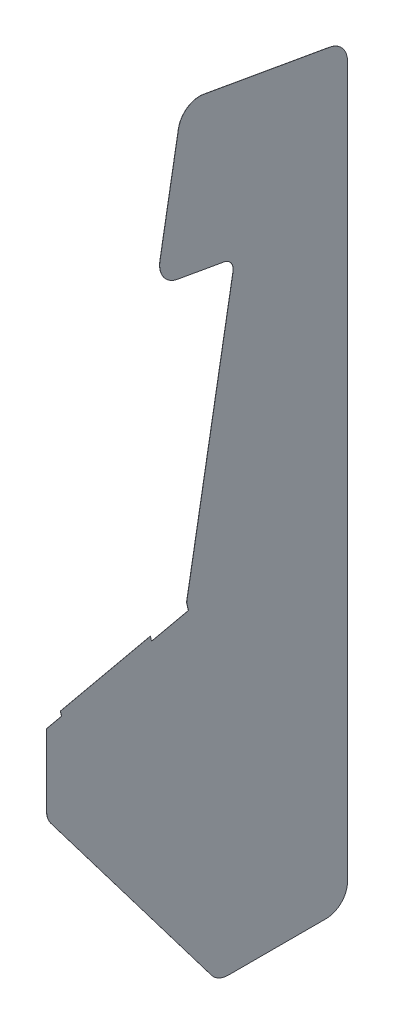
ISO-10303-21;
HEADER;
FILE_DESCRIPTION(('STEP AP214'),'2;1');
FILE_NAME('part.step','',(''),(''),'','','');
FILE_SCHEMA(('AUTOMOTIVE_DESIGN { 1 0 10303 214 1 1 1 1 }'));
ENDSEC;
DATA;
#1=APPLICATION_CONTEXT('core data for automotive mechanical design processes');
#2=APPLICATION_PROTOCOL_DEFINITION('international standard','automotive_design',2000,#1);
#3=PRODUCT_CONTEXT('',#1,'mechanical');
#4=PRODUCT('Part','Part','',(#3));
#5=PRODUCT_RELATED_PRODUCT_CATEGORY('part','',(#4));
#6=PRODUCT_DEFINITION_FORMATION('','',#4);
#7=PRODUCT_DEFINITION_CONTEXT('part definition',#1,'design');
#8=PRODUCT_DEFINITION('design','',#6,#7);
#9=PRODUCT_DEFINITION_SHAPE('','',#8);
#10=(LENGTH_UNIT() NAMED_UNIT(*) SI_UNIT(.MILLI.,.METRE.));
#11=(NAMED_UNIT(*) PLANE_ANGLE_UNIT() SI_UNIT($,.RADIAN.));
#12=(NAMED_UNIT(*) SI_UNIT($,.STERADIAN.) SOLID_ANGLE_UNIT());
#13=UNCERTAINTY_MEASURE_WITH_UNIT(LENGTH_MEASURE(1.E-05),#10,'distance_accuracy_value','');
#14=(GEOMETRIC_REPRESENTATION_CONTEXT(3) GLOBAL_UNCERTAINTY_ASSIGNED_CONTEXT((#13)) GLOBAL_UNIT_ASSIGNED_CONTEXT((#10,
#11,#12)) REPRESENTATION_CONTEXT('',''));
#15=CARTESIAN_POINT('',(0.,0.,0.));
#16=DIRECTION('',(0.,0.,1.));
#17=DIRECTION('',(1.,0.,0.));
#18=AXIS2_PLACEMENT_3D('',#15,#16,#17);
#19=CARTESIAN_POINT('',(-0.1016,-432.193888214697,-274.200562117222));
#20=DIRECTION('',(1.,0.,0.));
#21=DIRECTION('',(0.,0.,-1.));
#22=AXIS2_PLACEMENT_3D('',#19,#20,#21);
#23=CYLINDRICAL_SURFACE('',#22,33.3375);
#24=CARTESIAN_POINT('',(0.1016,-432.193888214697,-274.200562117222));
#25=DIRECTION('',(1.,0.,0.));
#26=DIRECTION('',(0.,0.,-1.));
#27=AXIS2_PLACEMENT_3D('',#24,#25,#26);
#28=CIRCLE('',#27,33.3375);
#29=CARTESIAN_POINT('',(0.1016,-452.33460121024,-247.634783636606));
#30=VERTEX_POINT('',#29);
#31=CARTESIAN_POINT('',(0.1016,-465.531388214697,-274.200562117222));
#32=VERTEX_POINT('',#31);
#33=EDGE_CURVE('E209',#30,#32,#28,.T.);
#34=ORIENTED_EDGE('',*,*,#33,.F.);
#35=DIRECTION('',(1.,0.,0.));
#36=VECTOR('',#35,1.);
#37=CARTESIAN_POINT('',(-0.1016,-452.33460121024,-247.634783636606));
#38=LINE('',#37,#36);
#39=CARTESIAN_POINT('',(-0.1016,-452.33460121024,-247.634783636606));
#40=VERTEX_POINT('',#39);
#41=EDGE_CURVE('E11',#40,#30,#38,.T.);
#42=ORIENTED_EDGE('',*,*,#41,.F.);
#43=CARTESIAN_POINT('',(-0.1016,-432.193888214697,-274.200562117222));
#44=DIRECTION('',(1.,0.,0.));
#45=DIRECTION('',(0.,0.,-1.));
#46=AXIS2_PLACEMENT_3D('',#43,#44,#45);
#47=CIRCLE('',#46,33.3375);
#48=CARTESIAN_POINT('',(-0.1016,-465.531388214697,-274.200562117222));
#49=VERTEX_POINT('',#48);
#50=EDGE_CURVE('E268',#40,#49,#47,.T.);
#51=ORIENTED_EDGE('',*,*,#50,.T.);
#52=DIRECTION('',(1.,0.,0.));
#53=VECTOR('',#52,1.);
#54=CARTESIAN_POINT('',(-0.1016,-465.531388214697,-274.200562117222));
#55=LINE('',#54,#53);
#56=EDGE_CURVE('E38',#49,#32,#55,.T.);
#57=ORIENTED_EDGE('',*,*,#56,.T.);
#58=EDGE_LOOP('',(#34,#42,#51,#57));
#59=FACE_BOUND('',#58,.T.);
#60=ADVANCED_FACE('F34',(#59),#23,.T.);
#61=CARTESIAN_POINT('',(-0.1016,-124.164460435114,1.16577848061592));
#62=DIRECTION('',(0.,-0.604145871632343,0.796873745200327));
#63=DIRECTION('',(0.,-0.796873745200327,-0.604145871632343));
#64=AXIS2_PLACEMENT_3D('',#61,#62,#63);
#65=PLANE('',#64);
#66=DIRECTION('',(0.,-0.796873745200327,-0.604145871632344));
#67=VECTOR('',#66,1.);
#68=CARTESIAN_POINT('',(0.1016,-124.164460435114,1.16577848061592));
#69=LINE('',#68,#67);
#70=CARTESIAN_POINT('',(0.1016,-124.164460435114,1.16577848061593));
#71=VERTEX_POINT('',#70);
#72=EDGE_CURVE('E266',#71,#30,#69,.T.);
#73=ORIENTED_EDGE('',*,*,#72,.F.);
#74=DIRECTION('',(1.,0.,0.));
#75=VECTOR('',#74,1.);
#76=CARTESIAN_POINT('',(-0.1016,-124.164460435114,1.16577848061593));
#77=LINE('',#76,#75);
#78=CARTESIAN_POINT('',(-0.1016,-124.164460435114,1.16577848061593));
#79=VERTEX_POINT('',#78);
#80=EDGE_CURVE('E44',#79,#71,#77,.T.);
#81=ORIENTED_EDGE('',*,*,#80,.F.);
#82=DIRECTION('',(0.,-0.796873745200327,-0.604145871632344));
#83=VECTOR('',#82,1.);
#84=CARTESIAN_POINT('',(-0.1016,-124.164460435114,1.16577848061592));
#85=LINE('',#84,#83);
#86=EDGE_CURVE('E199',#79,#40,#85,.T.);
#87=ORIENTED_EDGE('',*,*,#86,.T.);
#88=ORIENTED_EDGE('',*,*,#41,.T.);
#89=EDGE_LOOP('',(#73,#81,#87,#88));
#90=FACE_BOUND('',#89,.T.);
#91=ADVANCED_FACE('F306',(#90),#65,.T.);
#92=CARTESIAN_POINT('',(-0.1016,-104.023747439571,-25.4));
#93=DIRECTION('',(1.,0.,0.));
#94=DIRECTION('',(0.,0.,-1.));
#95=AXIS2_PLACEMENT_3D('',#92,#93,#94);
#96=CYLINDRICAL_SURFACE('',#95,33.3375);
#97=CARTESIAN_POINT('',(0.1016,-104.023747439571,-25.4));
#98=DIRECTION('',(1.,0.,0.));
#99=DIRECTION('',(0.,0.,-1.));
#100=AXIS2_PLACEMENT_3D('',#97,#98,#99);
#101=CIRCLE('',#100,33.3375);
#102=CARTESIAN_POINT('',(0.1016,-104.023747439571,7.93750000000001));
#103=VERTEX_POINT('',#102);
#104=EDGE_CURVE('E187',#103,#71,#101,.T.);
#105=ORIENTED_EDGE('',*,*,#104,.F.);
#106=DIRECTION('',(1.,0.,0.));
#107=VECTOR('',#106,1.);
#108=CARTESIAN_POINT('',(-0.1016,-104.023747439571,7.93750000000001));
#109=LINE('',#108,#107);
#110=CARTESIAN_POINT('',(-0.1016,-104.023747439571,7.93750000000001));
#111=VERTEX_POINT('',#110);
#112=EDGE_CURVE('E182',#111,#103,#109,.T.);
#113=ORIENTED_EDGE('',*,*,#112,.F.);
#114=CARTESIAN_POINT('',(-0.1016,-104.023747439571,-25.4));
#115=DIRECTION('',(1.,0.,0.));
#116=DIRECTION('',(0.,0.,-1.));
#117=AXIS2_PLACEMENT_3D('',#114,#115,#116);
#118=CIRCLE('',#117,33.3375);
#119=EDGE_CURVE('E185',#111,#79,#118,.T.);
#120=ORIENTED_EDGE('',*,*,#119,.T.);
#121=ORIENTED_EDGE('',*,*,#80,.T.);
#122=EDGE_LOOP('',(#105,#113,#120,#121));
#123=FACE_BOUND('',#122,.T.);
#124=ADVANCED_FACE('F184',(#123),#96,.T.);
#125=CARTESIAN_POINT('',(-0.1016,6.37051726014308,7.93750000000003));
#126=DIRECTION('',(0.,0.,1.));
#127=DIRECTION('',(0.,-1.,0.));
#128=AXIS2_PLACEMENT_3D('',#125,#126,#127);
#129=PLANE('',#128);
#130=DIRECTION('',(0.,-1.,0.));
#131=VECTOR('',#130,1.);
#132=CARTESIAN_POINT('',(0.1016,6.37051726014308,7.93750000000003));
#133=LINE('',#132,#131);
#134=CARTESIAN_POINT('',(0.1016,6.37051726014308,7.93750000000003));
#135=VERTEX_POINT('',#134);
#136=EDGE_CURVE('E263',#135,#103,#133,.T.);
#137=ORIENTED_EDGE('',*,*,#136,.F.);
#138=DIRECTION('',(1.,0.,0.));
#139=VECTOR('',#138,1.);
#140=CARTESIAN_POINT('',(-0.1016,6.37051726014308,7.93750000000003));
#141=LINE('',#140,#139);
#142=CARTESIAN_POINT('',(-0.1016,6.37051726014308,7.93750000000003));
#143=VERTEX_POINT('',#142);
#144=EDGE_CURVE('E192',#143,#135,#141,.T.);
#145=ORIENTED_EDGE('',*,*,#144,.F.);
#146=DIRECTION('',(0.,-1.,0.));
#147=VECTOR('',#146,1.);
#148=CARTESIAN_POINT('',(-0.1016,6.37051726014308,7.93750000000003));
#149=LINE('',#148,#147);
#150=EDGE_CURVE('E197',#143,#111,#149,.T.);
#151=ORIENTED_EDGE('',*,*,#150,.T.);
#152=ORIENTED_EDGE('',*,*,#112,.T.);
#153=EDGE_LOOP('',(#137,#145,#151,#152));
#154=FACE_BOUND('',#153,.T.);
#155=ADVANCED_FACE('F201',(#154),#129,.T.);
#156=CARTESIAN_POINT('',(-0.1016,11.5289263149086,-15.3305795886981));
#157=DIRECTION('',(0.,0.976296007119933,0.216439613938103));
#158=DIRECTION('',(0.,-0.216439613938103,0.976296007119933));
#159=AXIS2_PLACEMENT_3D('',#156,#157,#158);
#160=PLANE('',#159);
#161=DIRECTION('',(0.,-0.216439613938103,0.976296007119933));
#162=VECTOR('',#161,1.);
#163=CARTESIAN_POINT('',(0.1016,11.5289263149086,-15.3305795886981));
#164=LINE('',#163,#162);
#165=CARTESIAN_POINT('',(0.1016,11.5289263149086,-15.3305795886981));
#166=VERTEX_POINT('',#165);
#167=EDGE_CURVE('E260',#166,#135,#164,.T.);
#168=ORIENTED_EDGE('',*,*,#167,.F.);
#169=DIRECTION('',(1.,0.,0.));
#170=VECTOR('',#169,1.);
#171=CARTESIAN_POINT('',(-0.1016,11.5289263149086,-15.3305795886981));
#172=LINE('',#171,#170);
#173=CARTESIAN_POINT('',(-0.1016,11.5289263149086,-15.3305795886981));
#174=VERTEX_POINT('',#173);
#175=EDGE_CURVE('E272',#174,#166,#172,.T.);
#176=ORIENTED_EDGE('',*,*,#175,.F.);
#177=DIRECTION('',(0.,-0.216439613938103,0.976296007119933));
#178=VECTOR('',#177,1.);
#179=CARTESIAN_POINT('',(-0.1016,11.5289263149086,-15.3305795886981));
#180=LINE('',#179,#178);
#181=EDGE_CURVE('E202',#174,#143,#180,.T.);
#182=ORIENTED_EDGE('',*,*,#181,.T.);
#183=ORIENTED_EDGE('',*,*,#144,.T.);
#184=EDGE_LOOP('',(#168,#176,#182,#183));
#185=FACE_BOUND('',#184,.T.);
#186=ADVANCED_FACE('F318',(#185),#160,.T.);
#187=CARTESIAN_POINT('',(-0.1016,19.2782758714231,-13.6125901530644));
#188=DIRECTION('',(0.,-0.216439613938102,0.976296007119934));
#189=DIRECTION('',(0.,-0.976296007119934,-0.216439613938102));
#190=AXIS2_PLACEMENT_3D('',#187,#188,#189);
#191=PLANE('',#190);
#192=DIRECTION('',(0.,-0.976296007119934,-0.216439613938102));
#193=VECTOR('',#192,1.);
#194=CARTESIAN_POINT('',(0.1016,19.2782758714231,-13.6125901530644));
#195=LINE('',#194,#193);
#196=CARTESIAN_POINT('',(0.1016,19.2782758714231,-13.6125901530644));
#197=VERTEX_POINT('',#196);
#198=EDGE_CURVE('E257',#197,#166,#195,.T.);
#199=ORIENTED_EDGE('',*,*,#198,.F.);
#200=DIRECTION('',(1.,0.,0.));
#201=VECTOR('',#200,1.);
#202=CARTESIAN_POINT('',(-0.1016,19.2782758714231,-13.6125901530644));
#203=LINE('',#202,#201);
#204=CARTESIAN_POINT('',(-0.1016,19.2782758714231,-13.6125901530644));
#205=VERTEX_POINT('',#204);
#206=EDGE_CURVE('E274',#205,#197,#203,.T.);
#207=ORIENTED_EDGE('',*,*,#206,.F.);
#208=DIRECTION('',(0.,-0.976296007119934,-0.216439613938102));
#209=VECTOR('',#208,1.);
#210=CARTESIAN_POINT('',(-0.1016,19.2782758714231,-13.6125901530644));
#211=LINE('',#210,#209);
#212=EDGE_CURVE('E204',#205,#174,#211,.T.);
#213=ORIENTED_EDGE('',*,*,#212,.T.);
#214=ORIENTED_EDGE('',*,*,#175,.T.);
#215=EDGE_LOOP('',(#199,#207,#213,#214));
#216=FACE_BOUND('',#215,.T.);
#217=ADVANCED_FACE('F321',(#216),#191,.T.);
#218=CARTESIAN_POINT('',(-0.1016,50.2020857128297,-153.100882170325));
#219=DIRECTION('',(0.,0.976296007119933,0.216439613938104));
#220=DIRECTION('',(0.,-0.216439613938104,0.976296007119933));
#221=AXIS2_PLACEMENT_3D('',#218,#219,#220);
#222=PLANE('',#221);
#223=DIRECTION('',(0.,-0.216439613938104,0.976296007119933));
#224=VECTOR('',#223,1.);
#225=CARTESIAN_POINT('',(0.1016,50.2020857128297,-153.100882170325));
#226=LINE('',#225,#224);
#227=CARTESIAN_POINT('',(0.1016,50.2020857128297,-153.100882170325));
#228=VERTEX_POINT('',#227);
#229=EDGE_CURVE('E254',#228,#197,#226,.T.);
#230=ORIENTED_EDGE('',*,*,#229,.F.);
#231=DIRECTION('',(1.,0.,0.));
#232=VECTOR('',#231,1.);
#233=CARTESIAN_POINT('',(-0.1016,50.2020857128297,-153.100882170325));
#234=LINE('',#233,#232);
#235=CARTESIAN_POINT('',(-0.1016,50.2020857128297,-153.100882170325));
#236=VERTEX_POINT('',#235);
#237=EDGE_CURVE('E276',#236,#228,#234,.T.);
#238=ORIENTED_EDGE('',*,*,#237,.F.);
#239=DIRECTION('',(0.,-0.216439613938104,0.976296007119933));
#240=VECTOR('',#239,1.);
#241=CARTESIAN_POINT('',(-0.1016,50.2020857128297,-153.100882170325));
#242=LINE('',#241,#240);
#243=EDGE_CURVE('E585',#236,#205,#242,.T.);
#244=ORIENTED_EDGE('',*,*,#243,.T.);
#245=ORIENTED_EDGE('',*,*,#206,.T.);
#246=EDGE_LOOP('',(#230,#238,#244,#245));
#247=FACE_BOUND('',#246,.T.);
#248=ADVANCED_FACE('F325',(#247),#222,.T.);
#249=CARTESIAN_POINT('',(-0.1016,42.4527361563152,-154.818871605959));
#250=DIRECTION('',(0.,0.216439613938109,-0.976296007119932));
#251=DIRECTION('',(0.,0.976296007119932,0.216439613938109));
#252=AXIS2_PLACEMENT_3D('',#249,#250,#251);
#253=PLANE('',#252);
#254=DIRECTION('',(0.,0.976296007119932,0.216439613938109));
#255=VECTOR('',#254,1.);
#256=CARTESIAN_POINT('',(0.1016,42.4527361563152,-154.818871605959));
#257=LINE('',#256,#255);
#258=CARTESIAN_POINT('',(0.1016,42.4527361563152,-154.818871605959));
#259=VERTEX_POINT('',#258);
#260=EDGE_CURVE('E251',#259,#228,#257,.T.);
#261=ORIENTED_EDGE('',*,*,#260,.F.);
#262=DIRECTION('',(1.,0.,0.));
#263=VECTOR('',#262,1.);
#264=CARTESIAN_POINT('',(-0.1016,42.4527361563152,-154.818871605959));
#265=LINE('',#264,#263);
#266=CARTESIAN_POINT('',(-0.1016,42.4527361563152,-154.818871605959));
#267=VERTEX_POINT('',#266);
#268=EDGE_CURVE('E278',#267,#259,#265,.T.);
#269=ORIENTED_EDGE('',*,*,#268,.F.);
#270=DIRECTION('',(0.,0.976296007119932,0.216439613938109));
#271=VECTOR('',#270,1.);
#272=CARTESIAN_POINT('',(-0.1016,42.4527361563152,-154.818871605959));
#273=LINE('',#272,#271);
#274=EDGE_CURVE('E589',#267,#236,#273,.T.);
#275=ORIENTED_EDGE('',*,*,#274,.T.);
#276=ORIENTED_EDGE('',*,*,#237,.T.);
#277=EDGE_LOOP('',(#261,#269,#275,#276));
#278=FACE_BOUND('',#277,.T.);
#279=ADVANCED_FACE('F329',(#278),#253,.T.);
#280=CARTESIAN_POINT('',(-0.1016,55.1397816501158,-212.046435601192));
#281=DIRECTION('',(0.,0.976296007119933,0.216439613938103));
#282=DIRECTION('',(0.,-0.216439613938104,0.976296007119933));
#283=AXIS2_PLACEMENT_3D('',#280,#281,#282);
#284=PLANE('',#283);
#285=DIRECTION('',(0.,-0.216439613938104,0.976296007119933));
#286=VECTOR('',#285,1.);
#287=CARTESIAN_POINT('',(0.1016,55.1397816501158,-212.046435601192));
#288=LINE('',#287,#286);
#289=CARTESIAN_POINT('',(0.1016,55.1397816501158,-212.046435601192));
#290=VERTEX_POINT('',#289);
#291=EDGE_CURVE('E248',#290,#259,#288,.T.);
#292=ORIENTED_EDGE('',*,*,#291,.F.);
#293=DIRECTION('',(1.,0.,0.));
#294=VECTOR('',#293,1.);
#295=CARTESIAN_POINT('',(-0.1016,55.1397816501158,-212.046435601192));
#296=LINE('',#295,#294);
#297=CARTESIAN_POINT('',(-0.1016,55.1397816501158,-212.046435601192));
#298=VERTEX_POINT('',#297);
#299=EDGE_CURVE('E280',#298,#290,#296,.T.);
#300=ORIENTED_EDGE('',*,*,#299,.F.);
#301=DIRECTION('',(0.,-0.216439613938104,0.976296007119933));
#302=VECTOR('',#301,1.);
#303=CARTESIAN_POINT('',(-0.1016,55.1397816501158,-212.046435601192));
#304=LINE('',#303,#302);
#305=EDGE_CURVE('E578',#298,#267,#304,.T.);
#306=ORIENTED_EDGE('',*,*,#305,.T.);
#307=ORIENTED_EDGE('',*,*,#268,.T.);
#308=EDGE_LOOP('',(#292,#300,#306,#307));
#309=FACE_BOUND('',#308,.T.);
#310=ADVANCED_FACE('F333',(#309),#284,.T.);
#311=CARTESIAN_POINT('',(-0.1016,67.5303867315654,-209.299504587718));
#312=DIRECTION('',(0.,-0.216439613938147,0.976296007119923));
#313=DIRECTION('',(0.,-0.976296007119924,-0.216439613938147));
#314=AXIS2_PLACEMENT_3D('',#311,#312,#313);
#315=PLANE('',#314);
#316=DIRECTION('',(0.,-0.976296007119923,-0.216439613938147));
#317=VECTOR('',#316,1.);
#318=CARTESIAN_POINT('',(0.1016,67.5303867315654,-209.299504587718));
#319=LINE('',#318,#317);
#320=CARTESIAN_POINT('',(0.1016,67.5303867315654,-209.299504587718));
#321=VERTEX_POINT('',#320);
#322=EDGE_CURVE('E245',#321,#290,#319,.T.);
#323=ORIENTED_EDGE('',*,*,#322,.F.);
#324=DIRECTION('',(1.,0.,0.));
#325=VECTOR('',#324,1.);
#326=CARTESIAN_POINT('',(-0.1016,67.5303867315654,-209.299504587718));
#327=LINE('',#326,#325);
#328=CARTESIAN_POINT('',(-0.1016,67.5303867315654,-209.299504587718));
#329=VERTEX_POINT('',#328);
#330=EDGE_CURVE('E282',#329,#321,#327,.T.);
#331=ORIENTED_EDGE('',*,*,#330,.F.);
#332=DIRECTION('',(0.,-0.976296007119923,-0.216439613938147));
#333=VECTOR('',#332,1.);
#334=CARTESIAN_POINT('',(-0.1016,67.5303867315654,-209.299504587718));
#335=LINE('',#334,#333);
#336=EDGE_CURVE('E574',#329,#298,#335,.T.);
#337=ORIENTED_EDGE('',*,*,#336,.T.);
#338=ORIENTED_EDGE('',*,*,#299,.T.);
#339=EDGE_LOOP('',(#323,#331,#337,#338));
#340=FACE_BOUND('',#339,.T.);
#341=ADVANCED_FACE('F337',(#340),#315,.T.);
#342=CARTESIAN_POINT('',(-0.1016,475.563415979599,-281.254490605301));
#343=DIRECTION('',(0.,0.173666327783955,0.984804552484419));
#344=DIRECTION('',(0.,-0.984804552484419,0.173666327783955));
#345=AXIS2_PLACEMENT_3D('',#342,#343,#344);
#346=PLANE('',#345);
#347=DIRECTION('',(0.,-0.984804552484419,0.173666327783955));
#348=VECTOR('',#347,1.);
#349=CARTESIAN_POINT('',(0.1016,475.563415979599,-281.254490605301));
#350=LINE('',#349,#348);
#351=CARTESIAN_POINT('',(0.1016,475.563415979599,-281.254490605301));
#352=VERTEX_POINT('',#351);
#353=EDGE_CURVE('E242',#352,#321,#350,.T.);
#354=ORIENTED_EDGE('',*,*,#353,.F.);
#355=DIRECTION('',(1.,0.,0.));
#356=VECTOR('',#355,1.);
#357=CARTESIAN_POINT('',(-0.1016,475.563415979599,-281.254490605301));
#358=LINE('',#357,#356);
#359=CARTESIAN_POINT('',(-0.1016,475.563415979599,-281.254490605301));
#360=VERTEX_POINT('',#359);
#361=EDGE_CURVE('E284',#360,#352,#358,.T.);
#362=ORIENTED_EDGE('',*,*,#361,.F.);
#363=DIRECTION('',(0.,-0.984804552484419,0.173666327783955));
#364=VECTOR('',#363,1.);
#365=CARTESIAN_POINT('',(-0.1016,475.563415979599,-281.254490605301));
#366=LINE('',#365,#364);
#367=EDGE_CURVE('E595',#360,#329,#366,.T.);
#368=ORIENTED_EDGE('',*,*,#367,.T.);
#369=ORIENTED_EDGE('',*,*,#330,.T.);
#370=EDGE_LOOP('',(#354,#362,#368,#369));
#371=FACE_BOUND('',#370,.T.);
#372=ADVANCED_FACE('F341',(#371),#346,.T.);
#373=CARTESIAN_POINT('',(-0.1016,478.596064228526,-264.057341107542));
#374=DIRECTION('',(1.,0.,0.));
#375=DIRECTION('',(0.,0.,-1.));
#376=AXIS2_PLACEMENT_3D('',#373,#374,#375);
#377=CYLINDRICAL_SURFACE('',#376,17.4625);
#378=CARTESIAN_POINT('',(0.1016,478.596064228526,-264.057341107542));
#379=DIRECTION('',(-1.,0.,0.));
#380=DIRECTION('',(0.,0.,-1.));
#381=AXIS2_PLACEMENT_3D('',#378,#379,#380);
#382=CIRCLE('',#381,17.4625);
#383=CARTESIAN_POINT('',(0.1016,495.793213726285,-267.08998935647));
#384=VERTEX_POINT('',#383);
#385=EDGE_CURVE('E239',#384,#352,#382,.T.);
#386=ORIENTED_EDGE('',*,*,#385,.F.);
#387=DIRECTION('',(1.,0.,0.));
#388=VECTOR('',#387,1.);
#389=CARTESIAN_POINT('',(-0.1016,495.793213726285,-267.08998935647));
#390=LINE('',#389,#388);
#391=CARTESIAN_POINT('',(-0.1016,495.793213726285,-267.08998935647));
#392=VERTEX_POINT('',#391);
#393=EDGE_CURVE('E286',#392,#384,#390,.T.);
#394=ORIENTED_EDGE('',*,*,#393,.F.);
#395=CARTESIAN_POINT('',(-0.1016,478.596064228526,-264.057341107542));
#396=DIRECTION('',(-1.,0.,0.));
#397=DIRECTION('',(0.,0.,-1.));
#398=AXIS2_PLACEMENT_3D('',#395,#396,#397);
#399=CIRCLE('',#398,17.4625);
#400=EDGE_CURVE('E567',#392,#360,#399,.T.);
#401=ORIENTED_EDGE('',*,*,#400,.T.);
#402=ORIENTED_EDGE('',*,*,#361,.T.);
#403=EDGE_LOOP('',(#386,#394,#401,#402));
#404=FACE_BOUND('',#403,.T.);
#405=ADVANCED_FACE('F345',(#404),#377,.F.);
#406=CARTESIAN_POINT('',(-0.1016,508.505588920071,-195.00229611461));
#407=DIRECTION('',(0.,-0.984804552484419,0.173666327783954));
#408=DIRECTION('',(0.,-0.173666327783954,-0.984804552484419));
#409=AXIS2_PLACEMENT_3D('',#406,#407,#408);
#410=PLANE('',#409);
#411=DIRECTION('',(0.,-0.173666327783954,-0.984804552484419));
#412=VECTOR('',#411,1.);
#413=CARTESIAN_POINT('',(0.1016,508.505588920071,-195.00229611461));
#414=LINE('',#413,#412);
#415=CARTESIAN_POINT('',(0.1016,508.505588920071,-195.00229611461));
#416=VERTEX_POINT('',#415);
#417=EDGE_CURVE('E236',#416,#384,#414,.T.);
#418=ORIENTED_EDGE('',*,*,#417,.F.);
#419=DIRECTION('',(1.,0.,0.));
#420=VECTOR('',#419,1.);
#421=CARTESIAN_POINT('',(-0.1016,508.505588920071,-195.00229611461));
#422=LINE('',#421,#420);
#423=CARTESIAN_POINT('',(-0.1016,508.505588920071,-195.00229611461));
#424=VERTEX_POINT('',#423);
#425=EDGE_CURVE('E288',#424,#416,#422,.T.);
#426=ORIENTED_EDGE('',*,*,#425,.F.);
#427=DIRECTION('',(0.,-0.173666327783954,-0.984804552484419));
#428=VECTOR('',#427,1.);
#429=CARTESIAN_POINT('',(-0.1016,508.505588920071,-195.00229611461));
#430=LINE('',#429,#428);
#431=EDGE_CURVE('E563',#424,#392,#430,.T.);
#432=ORIENTED_EDGE('',*,*,#431,.T.);
#433=ORIENTED_EDGE('',*,*,#393,.T.);
#434=EDGE_LOOP('',(#418,#426,#432,#433));
#435=FACE_BOUND('',#434,.T.);
#436=ADVANCED_FACE('F349',(#435),#410,.T.);
#437=CARTESIAN_POINT('',(-0.1016,541.33651068852,-200.791897317108));
#438=DIRECTION('',(1.,0.,0.));
#439=DIRECTION('',(0.,0.,-1.));
#440=AXIS2_PLACEMENT_3D('',#437,#438,#439);
#441=CYLINDRICAL_SURFACE('',#440,33.3375);
#442=CARTESIAN_POINT('',(0.1016,541.33651068852,-200.791897317108));
#443=DIRECTION('',(1.,0.,0.));
#444=DIRECTION('',(0.,0.,-1.));
#445=AXIS2_PLACEMENT_3D('',#442,#443,#444);
#446=CIRCLE('',#445,33.3375);
#447=CARTESIAN_POINT('',(0.1016,547.126111891017,-167.960975548659));
#448=VERTEX_POINT('',#447);
#449=EDGE_CURVE('E233',#448,#416,#446,.T.);
#450=ORIENTED_EDGE('',*,*,#449,.F.);
#451=DIRECTION('',(1.,0.,0.));
#452=VECTOR('',#451,1.);
#453=CARTESIAN_POINT('',(-0.1016,547.126111891017,-167.960975548659));
#454=LINE('',#453,#452);
#455=CARTESIAN_POINT('',(-0.1016,547.126111891017,-167.960975548659));
#456=VERTEX_POINT('',#455);
#457=EDGE_CURVE('E290',#456,#448,#454,.T.);
#458=ORIENTED_EDGE('',*,*,#457,.F.);
#459=CARTESIAN_POINT('',(-0.1016,541.33651068852,-200.791897317108));
#460=DIRECTION('',(1.,0.,0.));
#461=DIRECTION('',(0.,0.,-1.));
#462=AXIS2_PLACEMENT_3D('',#459,#460,#461);
#463=CIRCLE('',#462,33.3375);
#464=EDGE_CURVE('E599',#456,#424,#463,.T.);
#465=ORIENTED_EDGE('',*,*,#464,.T.);
#466=ORIENTED_EDGE('',*,*,#425,.T.);
#467=EDGE_LOOP('',(#450,#458,#465,#466));
#468=FACE_BOUND('',#467,.T.);
#469=ADVANCED_FACE('F353',(#468),#441,.T.);
#470=CARTESIAN_POINT('',(-0.1016,709.717343506195,-196.63328626579));
#471=DIRECTION('',(0.,0.173666327783955,0.984804552484419));
#472=DIRECTION('',(0.,-0.984804552484419,0.173666327783955));
#473=AXIS2_PLACEMENT_3D('',#470,#471,#472);
#474=PLANE('',#473);
#475=DIRECTION('',(0.,-0.984804552484418,0.173666327783955));
#476=VECTOR('',#475,1.);
#477=CARTESIAN_POINT('',(0.1016,709.717343506195,-196.63328626579));
#478=LINE('',#477,#476);
#479=CARTESIAN_POINT('',(0.1016,709.717343506195,-196.63328626579));
#480=VERTEX_POINT('',#479);
#481=EDGE_CURVE('E230',#480,#448,#478,.T.);
#482=ORIENTED_EDGE('',*,*,#481,.F.);
#483=DIRECTION('',(1.,0.,0.));
#484=VECTOR('',#483,1.);
#485=CARTESIAN_POINT('',(-0.1016,709.717343506195,-196.63328626579));
#486=LINE('',#485,#484);
#487=CARTESIAN_POINT('',(-0.1016,709.717343506195,-196.63328626579));
#488=VERTEX_POINT('',#487);
#489=EDGE_CURVE('E292',#488,#480,#486,.T.);
#490=ORIENTED_EDGE('',*,*,#489,.F.);
#491=DIRECTION('',(0.,-0.984804552484418,0.173666327783955));
#492=VECTOR('',#491,1.);
#493=CARTESIAN_POINT('',(-0.1016,709.717343506195,-196.63328626579));
#494=LINE('',#493,#492);
#495=EDGE_CURVE('E556',#488,#456,#494,.T.);
#496=ORIENTED_EDGE('',*,*,#495,.T.);
#497=ORIENTED_EDGE('',*,*,#457,.T.);
#498=EDGE_LOOP('',(#482,#490,#496,#497));
#499=FACE_BOUND('',#498,.T.);
#500=ADVANCED_FACE('F357',(#499),#474,.T.);
#501=CARTESIAN_POINT('',(-0.1016,703.927742303697,-229.464208034239));
#502=DIRECTION('',(1.,0.,0.));
#503=DIRECTION('',(0.,0.,-1.));
#504=AXIS2_PLACEMENT_3D('',#501,#502,#503);
#505=CYLINDRICAL_SURFACE('',#504,33.3374999999999);
#506=CARTESIAN_POINT('',(0.1016,703.927742303697,-229.464208034239));
#507=DIRECTION('',(1.,0.,0.));
#508=DIRECTION('',(0.,0.,-1.));
#509=AXIS2_PLACEMENT_3D('',#506,#507,#508);
#510=CIRCLE('',#509,33.3374999999999);
#511=CARTESIAN_POINT('',(0.1016,736.758664072147,-235.253809236736));
#512=VERTEX_POINT('',#511);
#513=EDGE_CURVE('E227',#512,#480,#510,.T.);
#514=ORIENTED_EDGE('',*,*,#513,.F.);
#515=DIRECTION('',(1.,0.,0.));
#516=VECTOR('',#515,1.);
#517=CARTESIAN_POINT('',(-0.1016,736.758664072147,-235.253809236736));
#518=LINE('',#517,#516);
#519=CARTESIAN_POINT('',(-0.1016,736.758664072147,-235.253809236736));
#520=VERTEX_POINT('',#519);
#521=EDGE_CURVE('E294',#520,#512,#518,.T.);
#522=ORIENTED_EDGE('',*,*,#521,.F.);
#523=CARTESIAN_POINT('',(-0.1016,703.927742303697,-229.464208034239));
#524=DIRECTION('',(1.,0.,0.));
#525=DIRECTION('',(0.,0.,-1.));
#526=AXIS2_PLACEMENT_3D('',#523,#524,#525);
#527=CIRCLE('',#526,33.3374999999999);
#528=EDGE_CURVE('E552',#520,#488,#527,.T.);
#529=ORIENTED_EDGE('',*,*,#528,.T.);
#530=ORIENTED_EDGE('',*,*,#489,.T.);
#531=EDGE_LOOP('',(#514,#522,#529,#530));
#532=FACE_BOUND('',#531,.T.);
#533=ADVANCED_FACE('F361',(#532),#505,.T.);
#534=CARTESIAN_POINT('',(-0.1016,702.197356752172,-431.239601202498));
#535=DIRECTION('',(0.,0.984804552484419,-0.173666327783955));
#536=DIRECTION('',(0.,0.173666327783955,0.984804552484419));
#537=AXIS2_PLACEMENT_3D('',#534,#535,#536);
#538=PLANE('',#537);
#539=DIRECTION('',(0.,0.173666327783955,0.984804552484419));
#540=VECTOR('',#539,1.);
#541=CARTESIAN_POINT('',(0.1016,702.197356752172,-431.239601202498));
#542=LINE('',#541,#540);
#543=CARTESIAN_POINT('',(0.1016,702.197356752172,-431.239601202498));
#544=VERTEX_POINT('',#543);
#545=EDGE_CURVE('E224',#544,#512,#542,.T.);
#546=ORIENTED_EDGE('',*,*,#545,.F.);
#547=DIRECTION('',(1.,0.,0.));
#548=VECTOR('',#547,1.);
#549=CARTESIAN_POINT('',(-0.1016,702.197356752172,-431.239601202498));
#550=LINE('',#549,#548);
#551=CARTESIAN_POINT('',(-0.1016,702.197356752172,-431.239601202498));
#552=VERTEX_POINT('',#551);
#553=EDGE_CURVE('E296',#552,#544,#550,.T.);
#554=ORIENTED_EDGE('',*,*,#553,.F.);
#555=DIRECTION('',(0.,0.173666327783955,0.984804552484419));
#556=VECTOR('',#555,1.);
#557=CARTESIAN_POINT('',(-0.1016,702.197356752172,-431.239601202498));
#558=LINE('',#557,#556);
#559=EDGE_CURVE('E603',#552,#520,#558,.T.);
#560=ORIENTED_EDGE('',*,*,#559,.T.);
#561=ORIENTED_EDGE('',*,*,#521,.T.);
#562=EDGE_LOOP('',(#546,#554,#560,#561));
#563=FACE_BOUND('',#562,.T.);
#564=ADVANCED_FACE('F365',(#563),#538,.T.);
#565=CARTESIAN_POINT('',(-0.1016,669.366434983723,-425.45));
#566=DIRECTION('',(1.,0.,0.));
#567=DIRECTION('',(0.,0.,-1.));
#568=AXIS2_PLACEMENT_3D('',#565,#566,#567);
#569=CYLINDRICAL_SURFACE('',#568,33.3375);
#570=CARTESIAN_POINT('',(0.1016,669.366434983723,-425.45));
#571=DIRECTION('',(1.,0.,0.));
#572=DIRECTION('',(0.,0.,-1.));
#573=AXIS2_PLACEMENT_3D('',#570,#571,#572);
#574=CIRCLE('',#573,33.3375);
#575=CARTESIAN_POINT('',(0.1016,669.366434983723,-458.7875));
#576=VERTEX_POINT('',#575);
#577=EDGE_CURVE('E221',#576,#544,#574,.T.);
#578=ORIENTED_EDGE('',*,*,#577,.F.);
#579=DIRECTION('',(1.,0.,0.));
#580=VECTOR('',#579,1.);
#581=CARTESIAN_POINT('',(-0.1016,669.366434983723,-458.7875));
#582=LINE('',#581,#580);
#583=CARTESIAN_POINT('',(-0.1016,669.366434983723,-458.7875));
#584=VERTEX_POINT('',#583);
#585=EDGE_CURVE('E298',#584,#576,#582,.T.);
#586=ORIENTED_EDGE('',*,*,#585,.F.);
#587=CARTESIAN_POINT('',(-0.1016,669.366434983723,-425.45));
#588=DIRECTION('',(1.,0.,0.));
#589=DIRECTION('',(0.,0.,-1.));
#590=AXIS2_PLACEMENT_3D('',#587,#588,#589);
#591=CIRCLE('',#590,33.3375);
#592=EDGE_CURVE('E545',#584,#552,#591,.T.);
#593=ORIENTED_EDGE('',*,*,#592,.T.);
#594=ORIENTED_EDGE('',*,*,#553,.T.);
#595=EDGE_LOOP('',(#578,#586,#593,#594));
#596=FACE_BOUND('',#595,.T.);
#597=ADVANCED_FACE('F369',(#596),#569,.T.);
#598=CARTESIAN_POINT('',(-0.1016,-432.193888214697,-458.7875));
#599=DIRECTION('',(0.,0.,-1.));
#600=DIRECTION('',(-1.,0.,0.));
#601=AXIS2_PLACEMENT_3D('',#598,#599,#600);
#602=PLANE('',#601);
#603=DIRECTION('',(0.,1.,0.));
#604=VECTOR('',#603,1.);
#605=CARTESIAN_POINT('',(0.1016,-432.193888214697,-458.7875));
#606=LINE('',#605,#604);
#607=CARTESIAN_POINT('',(0.1016,-432.193888214697,-458.7875));
#608=VERTEX_POINT('',#607);
#609=EDGE_CURVE('E218',#608,#576,#606,.T.);
#610=ORIENTED_EDGE('',*,*,#609,.F.);
#611=DIRECTION('',(1.,0.,0.));
#612=VECTOR('',#611,1.);
#613=CARTESIAN_POINT('',(-0.1016,-432.193888214697,-458.7875));
#614=LINE('',#613,#612);
#615=CARTESIAN_POINT('',(-0.1016,-432.193888214697,-458.7875));
#616=VERTEX_POINT('',#615);
#617=EDGE_CURVE('E300',#616,#608,#614,.T.);
#618=ORIENTED_EDGE('',*,*,#617,.F.);
#619=DIRECTION('',(0.,1.,0.));
#620=VECTOR('',#619,1.);
#621=CARTESIAN_POINT('',(-0.1016,-432.193888214697,-458.7875));
#622=LINE('',#621,#620);
#623=EDGE_CURVE('E541',#616,#584,#622,.T.);
#624=ORIENTED_EDGE('',*,*,#623,.T.);
#625=ORIENTED_EDGE('',*,*,#585,.T.);
#626=EDGE_LOOP('',(#610,#618,#624,#625));
#627=FACE_BOUND('',#626,.T.);
#628=ADVANCED_FACE('F373',(#627),#602,.T.);
#629=CARTESIAN_POINT('',(-0.1016,-432.193888214697,-425.45));
#630=DIRECTION('',(1.,0.,0.));
#631=DIRECTION('',(0.,0.,-1.));
#632=AXIS2_PLACEMENT_3D('',#629,#630,#631);
#633=CYLINDRICAL_SURFACE('',#632,33.3375);
#634=CARTESIAN_POINT('',(0.1016,-432.193888214697,-425.45));
#635=DIRECTION('',(1.,0.,0.));
#636=DIRECTION('',(0.,0.,-1.));
#637=AXIS2_PLACEMENT_3D('',#634,#635,#636);
#638=CIRCLE('',#637,33.3375);
#639=CARTESIAN_POINT('',(0.1016,-465.531388214697,-425.45));
#640=VERTEX_POINT('',#639);
#641=EDGE_CURVE('E215',#640,#608,#638,.T.);
#642=ORIENTED_EDGE('',*,*,#641,.F.);
#643=DIRECTION('',(1.,0.,0.));
#644=VECTOR('',#643,1.);
#645=CARTESIAN_POINT('',(-0.1016,-465.531388214697,-425.45));
#646=LINE('',#645,#644);
#647=CARTESIAN_POINT('',(-0.1016,-465.531388214697,-425.45));
#648=VERTEX_POINT('',#647);
#649=EDGE_CURVE('E301',#648,#640,#646,.T.);
#650=ORIENTED_EDGE('',*,*,#649,.F.);
#651=CARTESIAN_POINT('',(-0.1016,-432.193888214697,-425.45));
#652=DIRECTION('',(1.,0.,0.));
#653=DIRECTION('',(0.,0.,-1.));
#654=AXIS2_PLACEMENT_3D('',#651,#652,#653);
#655=CIRCLE('',#654,33.3375);
#656=EDGE_CURVE('E607',#648,#616,#655,.T.);
#657=ORIENTED_EDGE('',*,*,#656,.T.);
#658=ORIENTED_EDGE('',*,*,#617,.T.);
#659=EDGE_LOOP('',(#642,#650,#657,#658));
#660=FACE_BOUND('',#659,.T.);
#661=ADVANCED_FACE('F377',(#660),#633,.T.);
#662=CARTESIAN_POINT('',(-0.1016,-465.531388214697,-274.200562117222));
#663=DIRECTION('',(0.,-1.,0.));
#664=DIRECTION('',(0.,0.,-1.));
#665=AXIS2_PLACEMENT_3D('',#662,#663,#664);
#666=PLANE('',#665);
#667=DIRECTION('',(0.,0.,-1.));
#668=VECTOR('',#667,1.);
#669=CARTESIAN_POINT('',(0.1016,-465.531388214697,-274.200562117222));
#670=LINE('',#669,#668);
#671=EDGE_CURVE('E212',#32,#640,#670,.T.);
#672=ORIENTED_EDGE('',*,*,#671,.F.);
#673=ORIENTED_EDGE('',*,*,#56,.F.);
#674=DIRECTION('',(0.,0.,-1.));
#675=VECTOR('',#674,1.);
#676=CARTESIAN_POINT('',(-0.1016,-465.531388214697,-274.200562117222));
#677=LINE('',#676,#675);
#678=EDGE_CURVE('E609',#49,#648,#677,.T.);
#679=ORIENTED_EDGE('',*,*,#678,.T.);
#680=ORIENTED_EDGE('',*,*,#649,.T.);
#681=EDGE_LOOP('',(#672,#673,#679,#680));
#682=FACE_BOUND('',#681,.T.);
#683=ADVANCED_FACE('F303',(#682),#666,.T.);
#684=CARTESIAN_POINT('',(0.1016,0.,0.));
#685=DIRECTION('',(1.,0.,0.));
#686=DIRECTION('',(0.,0.,-1.));
#687=AXIS2_PLACEMENT_3D('',#684,#685,#686);
#688=PLANE('',#687);
#689=ORIENTED_EDGE('',*,*,#33,.T.);
#690=ORIENTED_EDGE('',*,*,#671,.T.);
#691=ORIENTED_EDGE('',*,*,#641,.T.);
#692=ORIENTED_EDGE('',*,*,#609,.T.);
#693=ORIENTED_EDGE('',*,*,#577,.T.);
#694=ORIENTED_EDGE('',*,*,#545,.T.);
#695=ORIENTED_EDGE('',*,*,#513,.T.);
#696=ORIENTED_EDGE('',*,*,#481,.T.);
#697=ORIENTED_EDGE('',*,*,#449,.T.);
#698=ORIENTED_EDGE('',*,*,#417,.T.);
#699=ORIENTED_EDGE('',*,*,#385,.T.);
#700=ORIENTED_EDGE('',*,*,#353,.T.);
#701=ORIENTED_EDGE('',*,*,#322,.T.);
#702=ORIENTED_EDGE('',*,*,#291,.T.);
#703=ORIENTED_EDGE('',*,*,#260,.T.);
#704=ORIENTED_EDGE('',*,*,#229,.T.);
#705=ORIENTED_EDGE('',*,*,#198,.T.);
#706=ORIENTED_EDGE('',*,*,#167,.T.);
#707=ORIENTED_EDGE('',*,*,#136,.T.);
#708=ORIENTED_EDGE('',*,*,#104,.T.);
#709=ORIENTED_EDGE('',*,*,#72,.T.);
#710=EDGE_LOOP('',(#689,#690,#691,#692,#693,#694,#695,#696,#697,#698,#699,#700,#701,#702,#703,
#704,#705,#706,#707,#708,#709));
#711=FACE_BOUND('',#710,.T.);
#712=ADVANCED_FACE('F305',(#711),#688,.T.);
#713=CARTESIAN_POINT('',(-0.1016,0.,0.));
#714=DIRECTION('',(1.,0.,0.));
#715=DIRECTION('',(0.,0.,-1.));
#716=AXIS2_PLACEMENT_3D('',#713,#714,#715);
#717=PLANE('',#716);
#718=ORIENTED_EDGE('',*,*,#50,.F.);
#719=ORIENTED_EDGE('',*,*,#86,.F.);
#720=ORIENTED_EDGE('',*,*,#119,.F.);
#721=ORIENTED_EDGE('',*,*,#150,.F.);
#722=ORIENTED_EDGE('',*,*,#181,.F.);
#723=ORIENTED_EDGE('',*,*,#212,.F.);
#724=ORIENTED_EDGE('',*,*,#243,.F.);
#725=ORIENTED_EDGE('',*,*,#274,.F.);
#726=ORIENTED_EDGE('',*,*,#305,.F.);
#727=ORIENTED_EDGE('',*,*,#336,.F.);
#728=ORIENTED_EDGE('',*,*,#367,.F.);
#729=ORIENTED_EDGE('',*,*,#400,.F.);
#730=ORIENTED_EDGE('',*,*,#431,.F.);
#731=ORIENTED_EDGE('',*,*,#464,.F.);
#732=ORIENTED_EDGE('',*,*,#495,.F.);
#733=ORIENTED_EDGE('',*,*,#528,.F.);
#734=ORIENTED_EDGE('',*,*,#559,.F.);
#735=ORIENTED_EDGE('',*,*,#592,.F.);
#736=ORIENTED_EDGE('',*,*,#623,.F.);
#737=ORIENTED_EDGE('',*,*,#656,.F.);
#738=ORIENTED_EDGE('',*,*,#678,.F.);
#739=EDGE_LOOP('',(#718,#719,#720,#721,#722,#723,#724,#725,#726,#727,#728,#729,#730,#731,#732,
#733,#734,#735,#736,#737,#738));
#740=FACE_BOUND('',#739,.T.);
#741=ADVANCED_FACE('F36',(#740),#717,.F.);
#742=CLOSED_SHELL('',(#60,#91,#124,#155,#186,#217,#248,#279,#310,#341,#372,#405,#436,#469,#500,
#533,#564,#597,#628,#661,#683,#712,#741));
#743=MANIFOLD_SOLID_BREP('B2',#742);
#744=ADVANCED_BREP_SHAPE_REPRESENTATION('',(#18,#743),#14);
#745=SHAPE_DEFINITION_REPRESENTATION(#9,#744);
ENDSEC;
END-ISO-10303-21;
